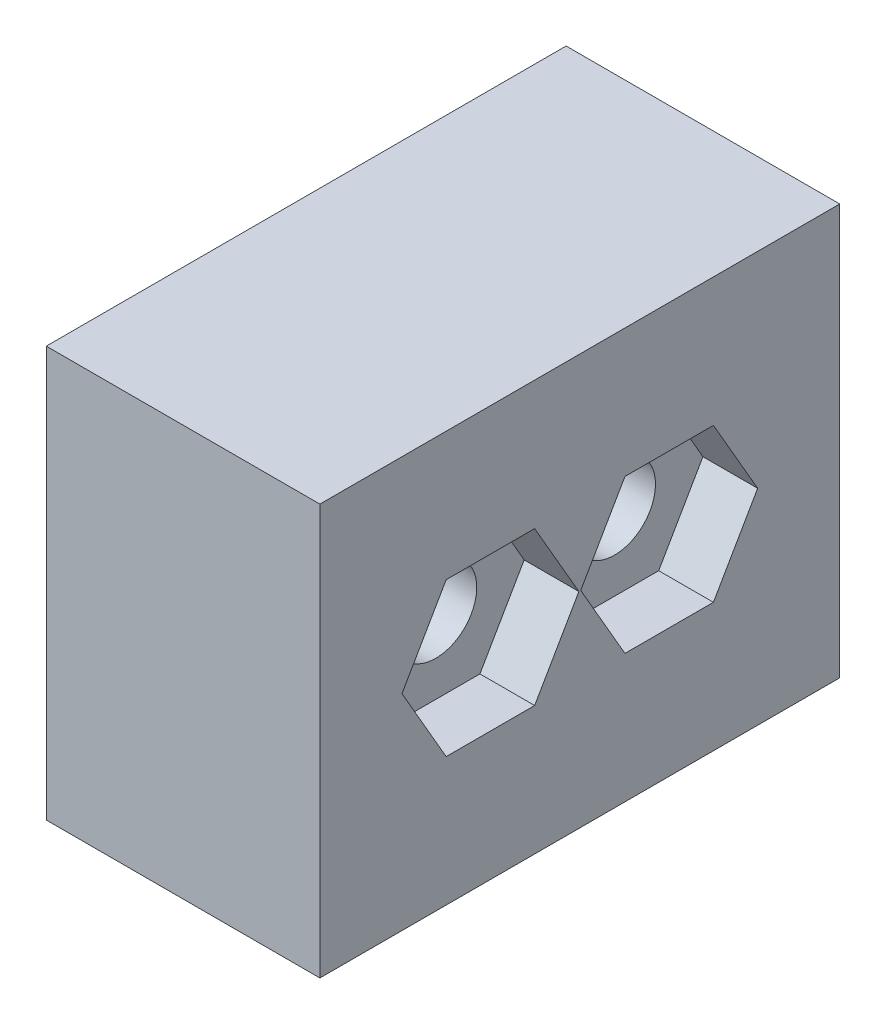
ISO-10303-21;
HEADER;
FILE_DESCRIPTION(('STEP AP214'),'2;1');
FILE_NAME('part.step','',(''),(''),'','','');
FILE_SCHEMA(('AUTOMOTIVE_DESIGN { 1 0 10303 214 1 1 1 1 }'));
ENDSEC;
DATA;
#1=APPLICATION_CONTEXT('core data for automotive mechanical design processes');
#2=APPLICATION_PROTOCOL_DEFINITION('international standard','automotive_design',2000,#1);
#3=PRODUCT_CONTEXT('',#1,'mechanical');
#4=PRODUCT('Part','Part','',(#3));
#5=PRODUCT_RELATED_PRODUCT_CATEGORY('part','',(#4));
#6=PRODUCT_DEFINITION_FORMATION('','',#4);
#7=PRODUCT_DEFINITION_CONTEXT('part definition',#1,'design');
#8=PRODUCT_DEFINITION('design','',#6,#7);
#9=PRODUCT_DEFINITION_SHAPE('','',#8);
#10=(LENGTH_UNIT() NAMED_UNIT(*) SI_UNIT(.MILLI.,.METRE.));
#11=(NAMED_UNIT(*) PLANE_ANGLE_UNIT() SI_UNIT($,.RADIAN.));
#12=(NAMED_UNIT(*) SI_UNIT($,.STERADIAN.) SOLID_ANGLE_UNIT());
#13=UNCERTAINTY_MEASURE_WITH_UNIT(LENGTH_MEASURE(1.E-05),#10,'distance_accuracy_value','');
#14=(GEOMETRIC_REPRESENTATION_CONTEXT(3) GLOBAL_UNCERTAINTY_ASSIGNED_CONTEXT((#13)) GLOBAL_UNIT_ASSIGNED_CONTEXT((#10,
#11,#12)) REPRESENTATION_CONTEXT('',''));
#15=CARTESIAN_POINT('',(0.,0.,0.));
#16=DIRECTION('',(0.,0.,1.));
#17=DIRECTION('',(1.,0.,0.));
#18=AXIS2_PLACEMENT_3D('',#15,#16,#17);
#19=CARTESIAN_POINT('',(-9.00000000000001,32.4999999999988,-12.7668384925381));
#20=DIRECTION('',(1.,0.,0.));
#21=DIRECTION('',(0.,1.,0.));
#22=AXIS2_PLACEMENT_3D('',#19,#20,#21);
#23=CYLINDRICAL_SURFACE('',#22,1.5);
#24=CARTESIAN_POINT('',(-9.00000000000001,32.4999999999988,-12.7668384925381));
#25=DIRECTION('',(1.,0.,0.));
#26=DIRECTION('',(0.,1.,0.));
#27=AXIS2_PLACEMENT_3D('',#24,#25,#26);
#28=CIRCLE('',#27,1.5);
#29=CARTESIAN_POINT('',(-9.00000000000001,33.9999999999988,-12.7668384925381));
#30=VERTEX_POINT('',#29);
#31=EDGE_CURVE('E253',#30,#30,#28,.T.);
#32=CARTESIAN_POINT('',(-1.,32.4999999999988,-12.7668384925381));
#33=DIRECTION('',(1.,0.,0.));
#34=DIRECTION('',(0.,1.,0.));
#35=AXIS2_PLACEMENT_3D('',#32,#33,#34);
#36=CIRCLE('',#35,1.5);
#37=CARTESIAN_POINT('',(-1.,33.9999999999988,-12.7668384925381));
#38=VERTEX_POINT('',#37);
#39=EDGE_CURVE('E174',#38,#38,#36,.T.);
#40=CARTESIAN_POINT('',(-9.00000000000001,33.9999999999988,-12.7668384925381));
#41=CARTESIAN_POINT('',(-8.91666666666667,33.9999999999988,-12.7668384925381));
#42=CARTESIAN_POINT('',(-8.83333333333334,33.9999999999988,-12.7668384925381));
#43=CARTESIAN_POINT('',(-8.66666666666667,33.9999999999988,-12.7668384925381));
#44=CARTESIAN_POINT('',(-8.58333333333334,33.9999999999988,-12.7668384925381));
#45=CARTESIAN_POINT('',(-8.41666666666667,33.9999999999988,-12.7668384925381));
#46=CARTESIAN_POINT('',(-8.33333333333334,33.9999999999988,-12.7668384925381));
#47=CARTESIAN_POINT('',(-8.16666666666667,33.9999999999988,-12.7668384925381));
#48=CARTESIAN_POINT('',(-8.08333333333334,33.9999999999988,-12.7668384925381));
#49=CARTESIAN_POINT('',(-7.91666666666667,33.9999999999988,-12.7668384925381));
#50=CARTESIAN_POINT('',(-7.83333333333334,33.9999999999988,-12.7668384925381));
#51=CARTESIAN_POINT('',(-7.66666666666667,33.9999999999988,-12.7668384925381));
#52=CARTESIAN_POINT('',(-7.58333333333334,33.9999999999988,-12.7668384925381));
#53=CARTESIAN_POINT('',(-7.41666666666667,33.9999999999988,-12.7668384925381));
#54=CARTESIAN_POINT('',(-7.33333333333334,33.9999999999988,-12.7668384925381));
#55=CARTESIAN_POINT('',(-7.16666666666667,33.9999999999988,-12.7668384925381));
#56=CARTESIAN_POINT('',(-7.08333333333334,33.9999999999988,-12.7668384925381));
#57=CARTESIAN_POINT('',(-6.91666666666667,33.9999999999988,-12.7668384925381));
#58=CARTESIAN_POINT('',(-6.83333333333334,33.9999999999988,-12.7668384925381));
#59=CARTESIAN_POINT('',(-6.66666666666667,33.9999999999988,-12.7668384925381));
#60=CARTESIAN_POINT('',(-6.58333333333334,33.9999999999988,-12.7668384925381));
#61=CARTESIAN_POINT('',(-6.41666666666667,33.9999999999988,-12.7668384925381));
#62=CARTESIAN_POINT('',(-6.33333333333334,33.9999999999988,-12.7668384925381));
#63=CARTESIAN_POINT('',(-6.16666666666667,33.9999999999988,-12.7668384925381));
#64=CARTESIAN_POINT('',(-6.08333333333334,33.9999999999988,-12.7668384925381));
#65=CARTESIAN_POINT('',(-5.91666666666667,33.9999999999988,-12.7668384925381));
#66=CARTESIAN_POINT('',(-5.83333333333334,33.9999999999988,-12.7668384925381));
#67=CARTESIAN_POINT('',(-5.66666666666667,33.9999999999988,-12.7668384925381));
#68=CARTESIAN_POINT('',(-5.58333333333334,33.9999999999988,-12.7668384925381));
#69=CARTESIAN_POINT('',(-5.41666666666667,33.9999999999988,-12.7668384925381));
#70=CARTESIAN_POINT('',(-5.33333333333334,33.9999999999988,-12.7668384925381));
#71=CARTESIAN_POINT('',(-5.16666666666667,33.9999999999988,-12.7668384925381));
#72=CARTESIAN_POINT('',(-5.08333333333334,33.9999999999988,-12.7668384925381));
#73=CARTESIAN_POINT('',(-4.91666666666667,33.9999999999988,-12.7668384925381));
#74=CARTESIAN_POINT('',(-4.83333333333334,33.9999999999988,-12.7668384925381));
#75=CARTESIAN_POINT('',(-4.66666666666667,33.9999999999988,-12.7668384925381));
#76=CARTESIAN_POINT('',(-4.58333333333334,33.9999999999988,-12.7668384925381));
#77=CARTESIAN_POINT('',(-4.41666666666667,33.9999999999988,-12.7668384925381));
#78=CARTESIAN_POINT('',(-4.33333333333334,33.9999999999988,-12.7668384925381));
#79=CARTESIAN_POINT('',(-4.16666666666667,33.9999999999988,-12.7668384925381));
#80=CARTESIAN_POINT('',(-4.08333333333334,33.9999999999988,-12.7668384925381));
#81=CARTESIAN_POINT('',(-3.91666666666667,33.9999999999988,-12.7668384925381));
#82=CARTESIAN_POINT('',(-3.83333333333334,33.9999999999988,-12.7668384925381));
#83=CARTESIAN_POINT('',(-3.66666666666667,33.9999999999988,-12.7668384925381));
#84=CARTESIAN_POINT('',(-3.58333333333334,33.9999999999988,-12.7668384925381));
#85=CARTESIAN_POINT('',(-3.41666666666667,33.9999999999988,-12.7668384925381));
#86=CARTESIAN_POINT('',(-3.33333333333334,33.9999999999988,-12.7668384925381));
#87=CARTESIAN_POINT('',(-3.16666666666667,33.9999999999988,-12.7668384925381));
#88=CARTESIAN_POINT('',(-3.08333333333334,33.9999999999988,-12.7668384925381));
#89=CARTESIAN_POINT('',(-2.91666666666667,33.9999999999988,-12.7668384925381));
#90=CARTESIAN_POINT('',(-2.83333333333334,33.9999999999988,-12.7668384925381));
#91=CARTESIAN_POINT('',(-2.66666666666667,33.9999999999988,-12.7668384925381));
#92=CARTESIAN_POINT('',(-2.58333333333334,33.9999999999988,-12.7668384925381));
#93=CARTESIAN_POINT('',(-2.41666666666667,33.9999999999988,-12.7668384925381));
#94=CARTESIAN_POINT('',(-2.33333333333334,33.9999999999988,-12.7668384925381));
#95=CARTESIAN_POINT('',(-2.16666666666667,33.9999999999988,-12.7668384925381));
#96=CARTESIAN_POINT('',(-2.08333333333334,33.9999999999988,-12.7668384925381));
#97=CARTESIAN_POINT('',(-1.91666666666667,33.9999999999988,-12.7668384925381));
#98=CARTESIAN_POINT('',(-1.83333333333334,33.9999999999988,-12.7668384925381));
#99=CARTESIAN_POINT('',(-1.66666666666667,33.9999999999988,-12.7668384925381));
#100=CARTESIAN_POINT('',(-1.58333333333333,33.9999999999988,-12.7668384925381));
#101=CARTESIAN_POINT('',(-1.41666666666667,33.9999999999988,-12.7668384925381));
#102=CARTESIAN_POINT('',(-1.33333333333333,33.9999999999988,-12.7668384925381));
#103=CARTESIAN_POINT('',(-1.16666666666667,33.9999999999988,-12.7668384925381));
#104=CARTESIAN_POINT('',(-1.08333333333334,33.9999999999988,-12.7668384925381));
#105=CARTESIAN_POINT('',(-1.,33.9999999999988,-12.7668384925381));
#106=B_SPLINE_CURVE_WITH_KNOTS('',3,(#40,#41,#42,#43,#44,#45,#46,#47,#48,#49,#50,#51,#52,#53,
#54,#55,#56,#57,#58,#59,#60,#61,#62,#63,#64,#65,#66,#67,#68,#69,#70,#71,#72,#73,#74,#75,#76,#77,
#78,#79,#80,#81,#82,#83,#84,#85,#86,#87,#88,#89,#90,#91,#92,#93,#94,#95,#96,#97,#98,#99,#100,
#101,#102,#103,#104,#105),.UNSPECIFIED.,.F.,.F.,(4,2,2,2,2,2,2,2,2,2,2,2,2,2,2,2,2,2,2,2,2,2,2,
2,2,2,2,2,2,2,2,2,4),(0.,0.25,0.5,0.750000000000001,1.,1.25,1.5,1.75,2.,2.25,2.5,2.75,3.,3.25,
3.5,3.75,4.,4.25,4.5,4.75,5.,5.25,5.5,5.75,6.,6.25,6.5,6.75,7.,7.25,7.50000000000001,
7.75000000000001,8.),.UNSPECIFIED.);
#107=EDGE_CURVE('BSEAM33',#30,#38,#106,.T.);
#108=ORIENTED_EDGE('',*,*,#31,.F.);
#109=ORIENTED_EDGE('',*,*,#39,.T.);
#110=ORIENTED_EDGE('',*,*,#107,.T.);
#111=ORIENTED_EDGE('',*,*,#107,.F.);
#112=EDGE_LOOP('',(#108,#110,#109,#111));
#113=FACE_BOUND('',#112,.T.);
#114=ADVANCED_FACE('F33',(#113),#23,.F.);
#115=CARTESIAN_POINT('',(1.,0.,0.));
#116=DIRECTION('',(-1.,0.,0.));
#117=DIRECTION('',(0.,-1.,0.));
#118=AXIS2_PLACEMENT_3D('',#115,#116,#117);
#119=PLANE('',#118);
#120=DIRECTION('',(0.,0.866025403784439,0.5));
#121=VECTOR('',#120,1.);
#122=CARTESIAN_POINT('',(0.999999999999999,32.4999999999988,-16.));
#123=LINE('',#122,#121);
#124=CARTESIAN_POINT('',(0.999999999999999,32.4999999999988,-16.));
#125=VERTEX_POINT('',#124);
#126=CARTESIAN_POINT('',(0.999999999999999,35.2999999999988,-14.3834192462691));
#127=VERTEX_POINT('',#126);
#128=EDGE_CURVE('E184',#125,#127,#123,.T.);
#129=ORIENTED_EDGE('',*,*,#128,.F.);
#130=DIRECTION('',(0.,0.866025403784439,-0.5));
#131=VECTOR('',#130,1.);
#132=CARTESIAN_POINT('',(0.999999999999999,29.6999999999988,-14.3834192462691));
#133=LINE('',#132,#131);
#134=CARTESIAN_POINT('',(0.999999999999999,29.6999999999988,-14.3834192462691));
#135=VERTEX_POINT('',#134);
#136=EDGE_CURVE('E50',#135,#125,#133,.T.);
#137=ORIENTED_EDGE('',*,*,#136,.F.);
#138=DIRECTION('',(0.,0.,-1.));
#139=VECTOR('',#138,1.);
#140=CARTESIAN_POINT('',(0.999999999999999,29.6999999999988,-11.1502577388071));
#141=LINE('',#140,#139);
#142=CARTESIAN_POINT('',(0.999999999999999,29.6999999999988,-11.1502577388071));
#143=VERTEX_POINT('',#142);
#144=EDGE_CURVE('E168',#143,#135,#141,.T.);
#145=ORIENTED_EDGE('',*,*,#144,.F.);
#146=DIRECTION('',(0.,-0.866025403784439,-0.499999999999999));
#147=VECTOR('',#146,1.);
#148=CARTESIAN_POINT('',(0.999999999999999,32.4999999999988,-9.53367698507619));
#149=LINE('',#148,#147);
#150=CARTESIAN_POINT('',(0.999999999999999,32.4999999999988,-9.53367698507619));
#151=VERTEX_POINT('',#150);
#152=EDGE_CURVE('E171',#151,#143,#149,.T.);
#153=ORIENTED_EDGE('',*,*,#152,.F.);
#154=DIRECTION('',(0.,-0.866025403784438,0.5));
#155=VECTOR('',#154,1.);
#156=CARTESIAN_POINT('',(0.999999999999999,35.2999999999988,-11.1502577388071));
#157=LINE('',#156,#155);
#158=CARTESIAN_POINT('',(0.999999999999999,35.2999999999988,-11.1502577388071));
#159=VERTEX_POINT('',#158);
#160=EDGE_CURVE('E189',#159,#151,#157,.T.);
#161=ORIENTED_EDGE('',*,*,#160,.F.);
#162=DIRECTION('',(0.,0.,1.));
#163=VECTOR('',#162,1.);
#164=CARTESIAN_POINT('',(0.999999999999999,35.2999999999988,-14.3834192462691));
#165=LINE('',#164,#163);
#166=EDGE_CURVE('E186',#127,#159,#165,.T.);
#167=ORIENTED_EDGE('',*,*,#166,.F.);
#168=EDGE_LOOP('',(#129,#137,#145,#153,#161,#167));
#169=FACE_BOUND('',#168,.T.);
#170=DIRECTION('',(0.,0.866025403784439,-0.499999999999999));
#171=VECTOR('',#170,1.);
#172=CARTESIAN_POINT('',(0.999999999999999,32.4999999999988,-9.46632301492381));
#173=LINE('',#172,#171);
#174=CARTESIAN_POINT('',(0.999999999999999,29.6999999999988,-7.84974226119286));
#175=VERTEX_POINT('',#174);
#176=CARTESIAN_POINT('',(0.999999999999999,32.4999999999988,-9.46632301492381));
#177=VERTEX_POINT('',#176);
#178=EDGE_CURVE('E228',#175,#177,#173,.T.);
#179=ORIENTED_EDGE('',*,*,#178,.F.);
#180=DIRECTION('',(0.,0.,-1.));
#181=VECTOR('',#180,1.);
#182=CARTESIAN_POINT('',(0.999999999999999,29.6999999999988,-7.84974226119286));
#183=LINE('',#182,#181);
#184=CARTESIAN_POINT('',(0.999999999999999,29.6999999999988,-4.61658075373095));
#185=VERTEX_POINT('',#184);
#186=EDGE_CURVE('E58',#185,#175,#183,.T.);
#187=ORIENTED_EDGE('',*,*,#186,.F.);
#188=DIRECTION('',(0.,-0.866025403784439,-0.5));
#189=VECTOR('',#188,1.);
#190=CARTESIAN_POINT('',(0.999999999999999,29.6999999999988,-4.61658075373095));
#191=LINE('',#190,#189);
#192=CARTESIAN_POINT('',(0.999999999999999,32.4999999999988,-3.));
#193=VERTEX_POINT('',#192);
#194=EDGE_CURVE('E211',#193,#185,#191,.T.);
#195=ORIENTED_EDGE('',*,*,#194,.F.);
#196=DIRECTION('',(0.,-0.866025403784439,0.5));
#197=VECTOR('',#196,1.);
#198=CARTESIAN_POINT('',(0.999999999999999,32.4999999999988,-3.));
#199=LINE('',#198,#197);
#200=CARTESIAN_POINT('',(0.999999999999999,35.2999999999988,-4.61658075373095));
#201=VERTEX_POINT('',#200);
#202=EDGE_CURVE('E237',#201,#193,#199,.T.);
#203=ORIENTED_EDGE('',*,*,#202,.F.);
#204=DIRECTION('',(0.,0.,1.));
#205=VECTOR('',#204,1.);
#206=CARTESIAN_POINT('',(0.999999999999999,35.2999999999988,-4.61658075373095));
#207=LINE('',#206,#205);
#208=CARTESIAN_POINT('',(0.999999999999999,35.2999999999988,-7.84974226119286));
#209=VERTEX_POINT('',#208);
#210=EDGE_CURVE('E234',#209,#201,#207,.T.);
#211=ORIENTED_EDGE('',*,*,#210,.F.);
#212=DIRECTION('',(0.,0.866025403784438,0.5));
#213=VECTOR('',#212,1.);
#214=CARTESIAN_POINT('',(0.999999999999999,35.2999999999988,-7.84974226119286));
#215=LINE('',#214,#213);
#216=EDGE_CURVE('E231',#177,#209,#215,.T.);
#217=ORIENTED_EDGE('',*,*,#216,.F.);
#218=EDGE_LOOP('',(#179,#187,#195,#203,#211,#217));
#219=FACE_BOUND('',#218,.T.);
#220=DIRECTION('',(0.,1.,0.));
#221=VECTOR('',#220,1.);
#222=CARTESIAN_POINT('',(0.999999999999999,24.9999999999988,0.));
#223=LINE('',#222,#221);
#224=CARTESIAN_POINT('',(0.999999999999999,24.9999999999988,0.));
#225=VERTEX_POINT('',#224);
#226=CARTESIAN_POINT('',(0.999999999999997,39.9999999999988,0.));
#227=VERTEX_POINT('',#226);
#228=EDGE_CURVE('E259',#225,#227,#223,.T.);
#229=ORIENTED_EDGE('',*,*,#228,.F.);
#230=DIRECTION('',(0.,0.,1.));
#231=VECTOR('',#230,1.);
#232=CARTESIAN_POINT('',(0.999999999999999,24.9999999999988,0.));
#233=LINE('',#232,#231);
#234=CARTESIAN_POINT('',(0.999999999999999,24.9999999999988,-19.));
#235=VERTEX_POINT('',#234);
#236=EDGE_CURVE('E269',#235,#225,#233,.T.);
#237=ORIENTED_EDGE('',*,*,#236,.F.);
#238=DIRECTION('',(0.,-1.,0.));
#239=VECTOR('',#238,1.);
#240=CARTESIAN_POINT('',(0.999999999999999,24.9999999999988,-19.));
#241=LINE('',#240,#239);
#242=CARTESIAN_POINT('',(0.999999999999997,39.9999999999988,-19.));
#243=VERTEX_POINT('',#242);
#244=EDGE_CURVE('E266',#243,#235,#241,.T.);
#245=ORIENTED_EDGE('',*,*,#244,.F.);
#246=DIRECTION('',(0.,0.,-1.));
#247=VECTOR('',#246,1.);
#248=CARTESIAN_POINT('',(0.999999999999997,39.9999999999988,0.));
#249=LINE('',#248,#247);
#250=EDGE_CURVE('E262',#227,#243,#249,.T.);
#251=ORIENTED_EDGE('',*,*,#250,.F.);
#252=EDGE_LOOP('',(#229,#237,#245,#251));
#253=FACE_BOUND('',#252,.T.);
#254=ADVANCED_FACE('F299',(#169,#219,#253),#119,.F.);
#255=CARTESIAN_POINT('',(-9.,0.,0.));
#256=DIRECTION('',(-1.,0.,0.));
#257=DIRECTION('',(0.,-1.,0.));
#258=AXIS2_PLACEMENT_3D('',#255,#256,#257);
#259=PLANE('',#258);
#260=CARTESIAN_POINT('',(-9.00000000000001,32.4999999999988,-6.2331615074619));
#261=DIRECTION('',(-1.,0.,0.));
#262=DIRECTION('',(0.,-1.,0.));
#263=AXIS2_PLACEMENT_3D('',#260,#261,#262);
#264=CIRCLE('',#263,1.5);
#265=CARTESIAN_POINT('',(-9.00000000000001,33.9999999999988,-6.2331615074619));
#266=VERTEX_POINT('',#265);
#267=EDGE_CURVE('E196',#266,#266,#264,.T.);
#268=ORIENTED_EDGE('',*,*,#267,.F.);
#269=EDGE_LOOP('',(#268));
#270=FACE_BOUND('',#269,.T.);
#271=DIRECTION('',(0.,1.,0.));
#272=VECTOR('',#271,1.);
#273=CARTESIAN_POINT('',(-9.,24.9999999999988,0.));
#274=LINE('',#273,#272);
#275=CARTESIAN_POINT('',(-9.,24.9999999999988,0.));
#276=VERTEX_POINT('',#275);
#277=CARTESIAN_POINT('',(-9.,39.9999999999988,0.));
#278=VERTEX_POINT('',#277);
#279=EDGE_CURVE('E256',#276,#278,#274,.T.);
#280=ORIENTED_EDGE('',*,*,#279,.T.);
#281=DIRECTION('',(0.,0.,-1.));
#282=VECTOR('',#281,1.);
#283=CARTESIAN_POINT('',(-9.,39.9999999999988,0.));
#284=LINE('',#283,#282);
#285=CARTESIAN_POINT('',(-9.,39.9999999999988,-19.));
#286=VERTEX_POINT('',#285);
#287=EDGE_CURVE('E274',#278,#286,#284,.T.);
#288=ORIENTED_EDGE('',*,*,#287,.T.);
#289=DIRECTION('',(0.,-1.,0.));
#290=VECTOR('',#289,1.);
#291=CARTESIAN_POINT('',(-9.,24.9999999999988,-19.));
#292=LINE('',#291,#290);
#293=CARTESIAN_POINT('',(-9.,24.9999999999988,-19.));
#294=VERTEX_POINT('',#293);
#295=EDGE_CURVE('E277',#286,#294,#292,.T.);
#296=ORIENTED_EDGE('',*,*,#295,.T.);
#297=DIRECTION('',(0.,0.,1.));
#298=VECTOR('',#297,1.);
#299=CARTESIAN_POINT('',(-9.,24.9999999999988,0.));
#300=LINE('',#299,#298);
#301=EDGE_CURVE('E263',#294,#276,#300,.T.);
#302=ORIENTED_EDGE('',*,*,#301,.T.);
#303=EDGE_LOOP('',(#280,#288,#296,#302));
#304=FACE_BOUND('',#303,.T.);
#305=ORIENTED_EDGE('',*,*,#31,.T.);
#306=EDGE_LOOP('',(#305));
#307=FACE_BOUND('',#306,.T.);
#308=ADVANCED_FACE('F292',(#270,#304,#307),#259,.T.);
#309=CARTESIAN_POINT('',(0.999999999999999,24.9999999999988,0.));
#310=DIRECTION('',(0.,0.,1.));
#311=DIRECTION('',(1.,0.,0.));
#312=AXIS2_PLACEMENT_3D('',#309,#310,#311);
#313=PLANE('',#312);
#314=ORIENTED_EDGE('',*,*,#279,.F.);
#315=DIRECTION('',(-1.,0.,0.));
#316=VECTOR('',#315,1.);
#317=CARTESIAN_POINT('',(0.999999999999999,24.9999999999988,0.));
#318=LINE('',#317,#316);
#319=EDGE_CURVE('E11',#225,#276,#318,.T.);
#320=ORIENTED_EDGE('',*,*,#319,.F.);
#321=ORIENTED_EDGE('',*,*,#228,.T.);
#322=DIRECTION('',(-1.,0.,0.));
#323=VECTOR('',#322,1.);
#324=CARTESIAN_POINT('',(0.999999999999997,39.9999999999988,0.));
#325=LINE('',#324,#323);
#326=EDGE_CURVE('E37',#227,#278,#325,.T.);
#327=ORIENTED_EDGE('',*,*,#326,.T.);
#328=EDGE_LOOP('',(#314,#320,#321,#327));
#329=FACE_BOUND('',#328,.T.);
#330=ADVANCED_FACE('F35',(#329),#313,.T.);
#331=CARTESIAN_POINT('',(0.999999999999999,24.9999999999988,0.));
#332=DIRECTION('',(0.,-1.,0.));
#333=DIRECTION('',(0.,0.,-1.));
#334=AXIS2_PLACEMENT_3D('',#331,#332,#333);
#335=PLANE('',#334);
#336=ORIENTED_EDGE('',*,*,#301,.F.);
#337=DIRECTION('',(-1.,0.,0.));
#338=VECTOR('',#337,1.);
#339=CARTESIAN_POINT('',(0.999999999999999,24.9999999999988,-19.));
#340=LINE('',#339,#338);
#341=EDGE_CURVE('E42',#235,#294,#340,.T.);
#342=ORIENTED_EDGE('',*,*,#341,.F.);
#343=ORIENTED_EDGE('',*,*,#236,.T.);
#344=ORIENTED_EDGE('',*,*,#319,.T.);
#345=EDGE_LOOP('',(#336,#342,#343,#344));
#346=FACE_BOUND('',#345,.T.);
#347=ADVANCED_FACE('F296',(#346),#335,.T.);
#348=CARTESIAN_POINT('',(0.999999999999999,24.9999999999988,-19.));
#349=DIRECTION('',(0.,0.,-1.));
#350=DIRECTION('',(-1.,0.,0.));
#351=AXIS2_PLACEMENT_3D('',#348,#349,#350);
#352=PLANE('',#351);
#353=ORIENTED_EDGE('',*,*,#295,.F.);
#354=DIRECTION('',(-1.,0.,0.));
#355=VECTOR('',#354,1.);
#356=CARTESIAN_POINT('',(0.999999999999997,39.9999999999988,-19.));
#357=LINE('',#356,#355);
#358=EDGE_CURVE('E282',#243,#286,#357,.T.);
#359=ORIENTED_EDGE('',*,*,#358,.F.);
#360=ORIENTED_EDGE('',*,*,#244,.T.);
#361=ORIENTED_EDGE('',*,*,#341,.T.);
#362=EDGE_LOOP('',(#353,#359,#360,#361));
#363=FACE_BOUND('',#362,.T.);
#364=ADVANCED_FACE('F302',(#363),#352,.T.);
#365=CARTESIAN_POINT('',(0.999999999999997,39.9999999999988,0.));
#366=DIRECTION('',(0.,1.,0.));
#367=DIRECTION('',(0.,0.,1.));
#368=AXIS2_PLACEMENT_3D('',#365,#366,#367);
#369=PLANE('',#368);
#370=ORIENTED_EDGE('',*,*,#287,.F.);
#371=ORIENTED_EDGE('',*,*,#326,.F.);
#372=ORIENTED_EDGE('',*,*,#250,.T.);
#373=ORIENTED_EDGE('',*,*,#358,.T.);
#374=EDGE_LOOP('',(#370,#371,#372,#373));
#375=FACE_BOUND('',#374,.T.);
#376=ADVANCED_FACE('F290',(#375),#369,.T.);
#377=CARTESIAN_POINT('',(-9.00000000000001,32.4999999999988,-6.2331615074619));
#378=DIRECTION('',(1.,0.,0.));
#379=DIRECTION('',(0.,1.,0.));
#380=AXIS2_PLACEMENT_3D('',#377,#378,#379);
#381=CYLINDRICAL_SURFACE('',#380,1.5);
#382=CARTESIAN_POINT('',(-1.,32.4999999999988,-6.2331615074619));
#383=DIRECTION('',(1.,0.,0.));
#384=DIRECTION('',(0.,-1.,0.));
#385=AXIS2_PLACEMENT_3D('',#382,#383,#384);
#386=CIRCLE('',#385,1.5);
#387=CARTESIAN_POINT('',(-1.,33.9999999999988,-6.2331615074619));
#388=VERTEX_POINT('',#387);
#389=EDGE_CURVE('E204',#388,#388,#386,.T.);
#390=CARTESIAN_POINT('',(-1.,33.9999999999988,-6.2331615074619));
#391=CARTESIAN_POINT('',(-1.08333333333334,33.9999999999988,-6.2331615074619));
#392=CARTESIAN_POINT('',(-1.16666666666667,33.9999999999988,-6.2331615074619));
#393=CARTESIAN_POINT('',(-1.33333333333334,33.9999999999988,-6.2331615074619));
#394=CARTESIAN_POINT('',(-1.41666666666667,33.9999999999988,-6.2331615074619));
#395=CARTESIAN_POINT('',(-1.58333333333334,33.9999999999988,-6.2331615074619));
#396=CARTESIAN_POINT('',(-1.66666666666667,33.9999999999988,-6.2331615074619));
#397=CARTESIAN_POINT('',(-1.83333333333334,33.9999999999988,-6.2331615074619));
#398=CARTESIAN_POINT('',(-1.91666666666667,33.9999999999988,-6.2331615074619));
#399=CARTESIAN_POINT('',(-2.08333333333334,33.9999999999988,-6.2331615074619));
#400=CARTESIAN_POINT('',(-2.16666666666667,33.9999999999988,-6.2331615074619));
#401=CARTESIAN_POINT('',(-2.33333333333334,33.9999999999988,-6.2331615074619));
#402=CARTESIAN_POINT('',(-2.41666666666667,33.9999999999988,-6.2331615074619));
#403=CARTESIAN_POINT('',(-2.58333333333334,33.9999999999988,-6.2331615074619));
#404=CARTESIAN_POINT('',(-2.66666666666667,33.9999999999988,-6.2331615074619));
#405=CARTESIAN_POINT('',(-2.83333333333334,33.9999999999988,-6.2331615074619));
#406=CARTESIAN_POINT('',(-2.91666666666667,33.9999999999988,-6.2331615074619));
#407=CARTESIAN_POINT('',(-3.08333333333334,33.9999999999988,-6.2331615074619));
#408=CARTESIAN_POINT('',(-3.16666666666667,33.9999999999988,-6.2331615074619));
#409=CARTESIAN_POINT('',(-3.33333333333334,33.9999999999988,-6.2331615074619));
#410=CARTESIAN_POINT('',(-3.41666666666667,33.9999999999988,-6.2331615074619));
#411=CARTESIAN_POINT('',(-3.58333333333334,33.9999999999988,-6.2331615074619));
#412=CARTESIAN_POINT('',(-3.66666666666667,33.9999999999988,-6.2331615074619));
#413=CARTESIAN_POINT('',(-3.83333333333334,33.9999999999988,-6.2331615074619));
#414=CARTESIAN_POINT('',(-3.91666666666667,33.9999999999988,-6.2331615074619));
#415=CARTESIAN_POINT('',(-4.08333333333334,33.9999999999988,-6.2331615074619));
#416=CARTESIAN_POINT('',(-4.16666666666667,33.9999999999988,-6.2331615074619));
#417=CARTESIAN_POINT('',(-4.33333333333334,33.9999999999988,-6.2331615074619));
#418=CARTESIAN_POINT('',(-4.41666666666667,33.9999999999988,-6.2331615074619));
#419=CARTESIAN_POINT('',(-4.58333333333334,33.9999999999988,-6.2331615074619));
#420=CARTESIAN_POINT('',(-4.66666666666667,33.9999999999988,-6.2331615074619));
#421=CARTESIAN_POINT('',(-4.83333333333334,33.9999999999988,-6.2331615074619));
#422=CARTESIAN_POINT('',(-4.91666666666667,33.9999999999988,-6.2331615074619));
#423=CARTESIAN_POINT('',(-5.08333333333334,33.9999999999988,-6.2331615074619));
#424=CARTESIAN_POINT('',(-5.16666666666667,33.9999999999988,-6.2331615074619));
#425=CARTESIAN_POINT('',(-5.33333333333334,33.9999999999988,-6.2331615074619));
#426=CARTESIAN_POINT('',(-5.41666666666667,33.9999999999988,-6.2331615074619));
#427=CARTESIAN_POINT('',(-5.58333333333334,33.9999999999988,-6.2331615074619));
#428=CARTESIAN_POINT('',(-5.66666666666667,33.9999999999988,-6.2331615074619));
#429=CARTESIAN_POINT('',(-5.83333333333334,33.9999999999988,-6.2331615074619));
#430=CARTESIAN_POINT('',(-5.91666666666667,33.9999999999988,-6.2331615074619));
#431=CARTESIAN_POINT('',(-6.08333333333334,33.9999999999988,-6.2331615074619));
#432=CARTESIAN_POINT('',(-6.16666666666667,33.9999999999988,-6.2331615074619));
#433=CARTESIAN_POINT('',(-6.33333333333334,33.9999999999988,-6.2331615074619));
#434=CARTESIAN_POINT('',(-6.41666666666667,33.9999999999988,-6.2331615074619));
#435=CARTESIAN_POINT('',(-6.58333333333334,33.9999999999988,-6.2331615074619));
#436=CARTESIAN_POINT('',(-6.66666666666667,33.9999999999988,-6.2331615074619));
#437=CARTESIAN_POINT('',(-6.83333333333334,33.9999999999988,-6.2331615074619));
#438=CARTESIAN_POINT('',(-6.91666666666667,33.9999999999988,-6.2331615074619));
#439=CARTESIAN_POINT('',(-7.08333333333334,33.9999999999988,-6.2331615074619));
#440=CARTESIAN_POINT('',(-7.16666666666667,33.9999999999988,-6.2331615074619));
#441=CARTESIAN_POINT('',(-7.33333333333334,33.9999999999988,-6.2331615074619));
#442=CARTESIAN_POINT('',(-7.41666666666667,33.9999999999988,-6.2331615074619));
#443=CARTESIAN_POINT('',(-7.58333333333334,33.9999999999988,-6.2331615074619));
#444=CARTESIAN_POINT('',(-7.66666666666667,33.9999999999988,-6.2331615074619));
#445=CARTESIAN_POINT('',(-7.83333333333334,33.9999999999988,-6.2331615074619));
#446=CARTESIAN_POINT('',(-7.91666666666667,33.9999999999988,-6.2331615074619));
#447=CARTESIAN_POINT('',(-8.08333333333334,33.9999999999988,-6.2331615074619));
#448=CARTESIAN_POINT('',(-8.16666666666667,33.9999999999988,-6.2331615074619));
#449=CARTESIAN_POINT('',(-8.33333333333334,33.9999999999988,-6.2331615074619));
#450=CARTESIAN_POINT('',(-8.41666666666667,33.9999999999988,-6.2331615074619));
#451=CARTESIAN_POINT('',(-8.58333333333334,33.9999999999988,-6.2331615074619));
#452=CARTESIAN_POINT('',(-8.66666666666667,33.9999999999988,-6.2331615074619));
#453=CARTESIAN_POINT('',(-8.83333333333334,33.9999999999988,-6.2331615074619));
#454=CARTESIAN_POINT('',(-8.91666666666667,33.9999999999988,-6.2331615074619));
#455=CARTESIAN_POINT('',(-9.00000000000001,33.9999999999988,-6.2331615074619));
#456=B_SPLINE_CURVE_WITH_KNOTS('',3,(#390,#391,#392,#393,#394,#395,#396,#397,#398,#399,#400,
#401,#402,#403,#404,#405,#406,#407,#408,#409,#410,#411,#412,#413,#414,#415,#416,#417,#418,#419,
#420,#421,#422,#423,#424,#425,#426,#427,#428,#429,#430,#431,#432,#433,#434,#435,#436,#437,#438,
#439,#440,#441,#442,#443,#444,#445,#446,#447,#448,#449,#450,#451,#452,#453,#454,#455),
.UNSPECIFIED.,.F.,.F.,(4,2,2,2,2,2,2,2,2,2,2,2,2,2,2,2,2,2,2,2,2,2,2,2,2,2,2,2,2,2,2,2,4),(0.,
0.249999999999999,0.5,0.75,1.,1.25,1.5,1.75,2.,2.25,2.5,2.75,3.,3.25,3.5,3.75,4.,4.25,4.5,4.75,
5.,5.25,5.5,5.75,6.,6.25,6.5,6.75,7.,7.25,7.5,7.75,8.),.UNSPECIFIED.);
#457=EDGE_CURVE('BSEAM309',#388,#266,#456,.T.);
#458=ORIENTED_EDGE('',*,*,#389,.T.);
#459=ORIENTED_EDGE('',*,*,#267,.T.);
#460=ORIENTED_EDGE('',*,*,#457,.T.);
#461=ORIENTED_EDGE('',*,*,#457,.F.);
#462=EDGE_LOOP('',(#458,#460,#459,#461));
#463=FACE_BOUND('',#462,.T.);
#464=ADVANCED_FACE('F309',(#463),#381,.F.);
#465=CARTESIAN_POINT('',(-1.,29.6999999999988,-14.3834192462691));
#466=DIRECTION('',(0.,-0.5,-0.866025403784439));
#467=DIRECTION('',(0.,0.866025403784439,-0.5));
#468=AXIS2_PLACEMENT_3D('',#465,#466,#467);
#469=PLANE('',#468);
#470=ORIENTED_EDGE('',*,*,#136,.T.);
#471=DIRECTION('',(1.,0.,0.));
#472=VECTOR('',#471,1.);
#473=CARTESIAN_POINT('',(-1.,32.4999999999988,-16.));
#474=LINE('',#473,#472);
#475=CARTESIAN_POINT('',(-1.,32.4999999999988,-16.));
#476=VERTEX_POINT('',#475);
#477=EDGE_CURVE('E145',#476,#125,#474,.T.);
#478=ORIENTED_EDGE('',*,*,#477,.F.);
#479=DIRECTION('',(0.,0.866025403784439,-0.5));
#480=VECTOR('',#479,1.);
#481=CARTESIAN_POINT('',(-1.,29.6999999999988,-14.3834192462691));
#482=LINE('',#481,#480);
#483=CARTESIAN_POINT('',(-1.,29.6999999999988,-14.3834192462691));
#484=VERTEX_POINT('',#483);
#485=EDGE_CURVE('E149',#484,#476,#482,.T.);
#486=ORIENTED_EDGE('',*,*,#485,.F.);
#487=DIRECTION('',(1.,0.,0.));
#488=VECTOR('',#487,1.);
#489=CARTESIAN_POINT('',(-1.,29.6999999999988,-14.3834192462691));
#490=LINE('',#489,#488);
#491=EDGE_CURVE('E194',#484,#135,#490,.T.);
#492=ORIENTED_EDGE('',*,*,#491,.T.);
#493=EDGE_LOOP('',(#470,#478,#486,#492));
#494=FACE_BOUND('',#493,.T.);
#495=ADVANCED_FACE('F147',(#494),#469,.F.);
#496=CARTESIAN_POINT('',(-1.,29.6999999999988,-11.1502577388071));
#497=DIRECTION('',(0.,-1.,0.));
#498=DIRECTION('',(1.,0.,0.));
#499=AXIS2_PLACEMENT_3D('',#496,#497,#498);
#500=PLANE('',#499);
#501=ORIENTED_EDGE('',*,*,#144,.T.);
#502=ORIENTED_EDGE('',*,*,#491,.F.);
#503=DIRECTION('',(0.,0.,-1.));
#504=VECTOR('',#503,1.);
#505=CARTESIAN_POINT('',(-1.,29.6999999999988,-11.1502577388071));
#506=LINE('',#505,#504);
#507=CARTESIAN_POINT('',(-1.,29.6999999999988,-11.1502577388071));
#508=VERTEX_POINT('',#507);
#509=EDGE_CURVE('E155',#508,#484,#506,.T.);
#510=ORIENTED_EDGE('',*,*,#509,.F.);
#511=DIRECTION('',(1.,0.,0.));
#512=VECTOR('',#511,1.);
#513=CARTESIAN_POINT('',(-1.,29.6999999999988,-11.1502577388071));
#514=LINE('',#513,#512);
#515=EDGE_CURVE('E197',#508,#143,#514,.T.);
#516=ORIENTED_EDGE('',*,*,#515,.T.);
#517=EDGE_LOOP('',(#501,#502,#510,#516));
#518=FACE_BOUND('',#517,.T.);
#519=ADVANCED_FACE('F380',(#518),#500,.F.);
#520=CARTESIAN_POINT('',(-1.,32.4999999999988,-9.53367698507619));
#521=DIRECTION('',(0.,-0.499999999999999,0.866025403784439));
#522=DIRECTION('',(0.,-0.866025403784439,-0.499999999999999));
#523=AXIS2_PLACEMENT_3D('',#520,#521,#522);
#524=PLANE('',#523);
#525=ORIENTED_EDGE('',*,*,#152,.T.);
#526=ORIENTED_EDGE('',*,*,#515,.F.);
#527=DIRECTION('',(0.,-0.866025403784439,-0.499999999999999));
#528=VECTOR('',#527,1.);
#529=CARTESIAN_POINT('',(-1.,32.4999999999988,-9.53367698507619));
#530=LINE('',#529,#528);
#531=CARTESIAN_POINT('',(-1.,32.4999999999988,-9.53367698507619));
#532=VERTEX_POINT('',#531);
#533=EDGE_CURVE('E180',#532,#508,#530,.T.);
#534=ORIENTED_EDGE('',*,*,#533,.F.);
#535=DIRECTION('',(1.,0.,0.));
#536=VECTOR('',#535,1.);
#537=CARTESIAN_POINT('',(-1.,32.4999999999988,-9.53367698507619));
#538=LINE('',#537,#536);
#539=EDGE_CURVE('E199',#532,#151,#538,.T.);
#540=ORIENTED_EDGE('',*,*,#539,.T.);
#541=EDGE_LOOP('',(#525,#526,#534,#540));
#542=FACE_BOUND('',#541,.T.);
#543=ADVANCED_FACE('F389',(#542),#524,.F.);
#544=CARTESIAN_POINT('',(-1.,35.2999999999988,-11.1502577388071));
#545=DIRECTION('',(0.,0.5,0.866025403784438));
#546=DIRECTION('',(0.,-0.866025403784438,0.5));
#547=AXIS2_PLACEMENT_3D('',#544,#545,#546);
#548=PLANE('',#547);
#549=ORIENTED_EDGE('',*,*,#160,.T.);
#550=ORIENTED_EDGE('',*,*,#539,.F.);
#551=DIRECTION('',(0.,-0.866025403784438,0.5));
#552=VECTOR('',#551,1.);
#553=CARTESIAN_POINT('',(-1.,35.2999999999988,-11.1502577388071));
#554=LINE('',#553,#552);
#555=CARTESIAN_POINT('',(-1.,35.2999999999988,-11.1502577388071));
#556=VERTEX_POINT('',#555);
#557=EDGE_CURVE('E177',#556,#532,#554,.T.);
#558=ORIENTED_EDGE('',*,*,#557,.F.);
#559=DIRECTION('',(1.,0.,0.));
#560=VECTOR('',#559,1.);
#561=CARTESIAN_POINT('',(-1.,35.2999999999988,-11.1502577388071));
#562=LINE('',#561,#560);
#563=EDGE_CURVE('E201',#556,#159,#562,.T.);
#564=ORIENTED_EDGE('',*,*,#563,.T.);
#565=EDGE_LOOP('',(#549,#550,#558,#564));
#566=FACE_BOUND('',#565,.T.);
#567=ADVANCED_FACE('F399',(#566),#548,.F.);
#568=CARTESIAN_POINT('',(-1.,35.2999999999988,-14.3834192462691));
#569=DIRECTION('',(0.,1.,0.));
#570=DIRECTION('',(-1.,0.,0.));
#571=AXIS2_PLACEMENT_3D('',#568,#569,#570);
#572=PLANE('',#571);
#573=ORIENTED_EDGE('',*,*,#166,.T.);
#574=ORIENTED_EDGE('',*,*,#563,.F.);
#575=DIRECTION('',(0.,0.,1.));
#576=VECTOR('',#575,1.);
#577=CARTESIAN_POINT('',(-1.,35.2999999999988,-14.3834192462691));
#578=LINE('',#577,#576);
#579=CARTESIAN_POINT('',(-1.,35.2999999999988,-14.3834192462691));
#580=VERTEX_POINT('',#579);
#581=EDGE_CURVE('E163',#580,#556,#578,.T.);
#582=ORIENTED_EDGE('',*,*,#581,.F.);
#583=DIRECTION('',(1.,0.,0.));
#584=VECTOR('',#583,1.);
#585=CARTESIAN_POINT('',(-1.,35.2999999999988,-14.3834192462691));
#586=LINE('',#585,#584);
#587=EDGE_CURVE('E154',#580,#127,#586,.T.);
#588=ORIENTED_EDGE('',*,*,#587,.T.);
#589=EDGE_LOOP('',(#573,#574,#582,#588));
#590=FACE_BOUND('',#589,.T.);
#591=ADVANCED_FACE('F409',(#590),#572,.F.);
#592=CARTESIAN_POINT('',(-1.,32.4999999999988,-16.));
#593=DIRECTION('',(0.,0.5,-0.866025403784439));
#594=DIRECTION('',(0.,0.866025403784439,0.5));
#595=AXIS2_PLACEMENT_3D('',#592,#593,#594);
#596=PLANE('',#595);
#597=ORIENTED_EDGE('',*,*,#128,.T.);
#598=ORIENTED_EDGE('',*,*,#587,.F.);
#599=DIRECTION('',(0.,0.866025403784439,0.5));
#600=VECTOR('',#599,1.);
#601=CARTESIAN_POINT('',(-1.,32.4999999999988,-16.));
#602=LINE('',#601,#600);
#603=EDGE_CURVE('E158',#476,#580,#602,.T.);
#604=ORIENTED_EDGE('',*,*,#603,.F.);
#605=ORIENTED_EDGE('',*,*,#477,.T.);
#606=EDGE_LOOP('',(#597,#598,#604,#605));
#607=FACE_BOUND('',#606,.T.);
#608=ADVANCED_FACE('F159',(#607),#596,.F.);
#609=CARTESIAN_POINT('',(-0.999999999999999,0.,0.));
#610=DIRECTION('',(1.,0.,0.));
#611=DIRECTION('',(0.,1.,0.));
#612=AXIS2_PLACEMENT_3D('',#609,#610,#611);
#613=PLANE('',#612);
#614=ORIENTED_EDGE('',*,*,#39,.F.);
#615=EDGE_LOOP('',(#614));
#616=FACE_BOUND('',#615,.T.);
#617=ORIENTED_EDGE('',*,*,#485,.T.);
#618=ORIENTED_EDGE('',*,*,#603,.T.);
#619=ORIENTED_EDGE('',*,*,#581,.T.);
#620=ORIENTED_EDGE('',*,*,#557,.T.);
#621=ORIENTED_EDGE('',*,*,#533,.T.);
#622=ORIENTED_EDGE('',*,*,#509,.T.);
#623=EDGE_LOOP('',(#617,#618,#619,#620,#621,#622));
#624=FACE_BOUND('',#623,.T.);
#625=ADVANCED_FACE('F165',(#616,#624),#613,.T.);
#626=CARTESIAN_POINT('',(-1.,29.6999999999988,-7.84974226119286));
#627=DIRECTION('',(0.,-1.,0.));
#628=DIRECTION('',(1.,0.,0.));
#629=AXIS2_PLACEMENT_3D('',#626,#627,#628);
#630=PLANE('',#629);
#631=ORIENTED_EDGE('',*,*,#186,.T.);
#632=DIRECTION('',(1.,0.,0.));
#633=VECTOR('',#632,1.);
#634=CARTESIAN_POINT('',(-1.,29.6999999999988,-7.84974226119286));
#635=LINE('',#634,#633);
#636=CARTESIAN_POINT('',(-1.,29.6999999999988,-7.84974226119286));
#637=VERTEX_POINT('',#636);
#638=EDGE_CURVE('E226',#637,#175,#635,.T.);
#639=ORIENTED_EDGE('',*,*,#638,.F.);
#640=DIRECTION('',(0.,0.,-1.));
#641=VECTOR('',#640,1.);
#642=CARTESIAN_POINT('',(-1.,29.6999999999988,-7.84974226119286));
#643=LINE('',#642,#641);
#644=CARTESIAN_POINT('',(-1.,29.6999999999988,-4.61658075373095));
#645=VERTEX_POINT('',#644);
#646=EDGE_CURVE('E207',#645,#637,#643,.T.);
#647=ORIENTED_EDGE('',*,*,#646,.F.);
#648=DIRECTION('',(1.,0.,0.));
#649=VECTOR('',#648,1.);
#650=CARTESIAN_POINT('',(-1.,29.6999999999988,-4.61658075373095));
#651=LINE('',#650,#649);
#652=EDGE_CURVE('E242',#645,#185,#651,.T.);
#653=ORIENTED_EDGE('',*,*,#652,.T.);
#654=EDGE_LOOP('',(#631,#639,#647,#653));
#655=FACE_BOUND('',#654,.T.);
#656=ADVANCED_FACE('F323',(#655),#630,.F.);
#657=CARTESIAN_POINT('',(-1.,29.6999999999988,-4.61658075373095));
#658=DIRECTION('',(0.,-0.5,0.866025403784439));
#659=DIRECTION('',(0.,-0.866025403784439,-0.5));
#660=AXIS2_PLACEMENT_3D('',#657,#658,#659);
#661=PLANE('',#660);
#662=ORIENTED_EDGE('',*,*,#194,.T.);
#663=ORIENTED_EDGE('',*,*,#652,.F.);
#664=DIRECTION('',(0.,-0.866025403784439,-0.5));
#665=VECTOR('',#664,1.);
#666=CARTESIAN_POINT('',(-1.,29.6999999999988,-4.61658075373095));
#667=LINE('',#666,#665);
#668=CARTESIAN_POINT('',(-1.,32.4999999999988,-3.));
#669=VERTEX_POINT('',#668);
#670=EDGE_CURVE('E223',#669,#645,#667,.T.);
#671=ORIENTED_EDGE('',*,*,#670,.F.);
#672=DIRECTION('',(1.,0.,0.));
#673=VECTOR('',#672,1.);
#674=CARTESIAN_POINT('',(-1.,32.4999999999988,-3.));
#675=LINE('',#674,#673);
#676=EDGE_CURVE('E244',#669,#193,#675,.T.);
#677=ORIENTED_EDGE('',*,*,#676,.T.);
#678=EDGE_LOOP('',(#662,#663,#671,#677));
#679=FACE_BOUND('',#678,.T.);
#680=ADVANCED_FACE('F445',(#679),#661,.F.);
#681=CARTESIAN_POINT('',(-1.,32.4999999999988,-3.));
#682=DIRECTION('',(0.,0.5,0.866025403784439));
#683=DIRECTION('',(0.,-0.866025403784439,0.5));
#684=AXIS2_PLACEMENT_3D('',#681,#682,#683);
#685=PLANE('',#684);
#686=ORIENTED_EDGE('',*,*,#202,.T.);
#687=ORIENTED_EDGE('',*,*,#676,.F.);
#688=DIRECTION('',(0.,-0.866025403784439,0.5));
#689=VECTOR('',#688,1.);
#690=CARTESIAN_POINT('',(-1.,32.4999999999988,-3.));
#691=LINE('',#690,#689);
#692=CARTESIAN_POINT('',(-1.,35.2999999999988,-4.61658075373095));
#693=VERTEX_POINT('',#692);
#694=EDGE_CURVE('E220',#693,#669,#691,.T.);
#695=ORIENTED_EDGE('',*,*,#694,.F.);
#696=DIRECTION('',(1.,0.,0.));
#697=VECTOR('',#696,1.);
#698=CARTESIAN_POINT('',(-1.,35.2999999999988,-4.61658075373095));
#699=LINE('',#698,#697);
#700=EDGE_CURVE('E246',#693,#201,#699,.T.);
#701=ORIENTED_EDGE('',*,*,#700,.T.);
#702=EDGE_LOOP('',(#686,#687,#695,#701));
#703=FACE_BOUND('',#702,.T.);
#704=ADVANCED_FACE('F453',(#703),#685,.F.);
#705=CARTESIAN_POINT('',(-1.,35.2999999999988,-4.61658075373095));
#706=DIRECTION('',(0.,1.,0.));
#707=DIRECTION('',(-1.,0.,0.));
#708=AXIS2_PLACEMENT_3D('',#705,#706,#707);
#709=PLANE('',#708);
#710=ORIENTED_EDGE('',*,*,#210,.T.);
#711=ORIENTED_EDGE('',*,*,#700,.F.);
#712=DIRECTION('',(0.,0.,1.));
#713=VECTOR('',#712,1.);
#714=CARTESIAN_POINT('',(-1.,35.2999999999988,-4.61658075373095));
#715=LINE('',#714,#713);
#716=CARTESIAN_POINT('',(-1.,35.2999999999988,-7.84974226119286));
#717=VERTEX_POINT('',#716);
#718=EDGE_CURVE('E217',#717,#693,#715,.T.);
#719=ORIENTED_EDGE('',*,*,#718,.F.);
#720=DIRECTION('',(1.,0.,0.));
#721=VECTOR('',#720,1.);
#722=CARTESIAN_POINT('',(-1.,35.2999999999988,-7.84974226119286));
#723=LINE('',#722,#721);
#724=EDGE_CURVE('E248',#717,#209,#723,.T.);
#725=ORIENTED_EDGE('',*,*,#724,.T.);
#726=EDGE_LOOP('',(#710,#711,#719,#725));
#727=FACE_BOUND('',#726,.T.);
#728=ADVANCED_FACE('F463',(#727),#709,.F.);
#729=CARTESIAN_POINT('',(-1.,35.2999999999988,-7.84974226119286));
#730=DIRECTION('',(0.,0.5,-0.866025403784438));
#731=DIRECTION('',(0.,0.866025403784438,0.5));
#732=AXIS2_PLACEMENT_3D('',#729,#730,#731);
#733=PLANE('',#732);
#734=ORIENTED_EDGE('',*,*,#216,.T.);
#735=ORIENTED_EDGE('',*,*,#724,.F.);
#736=DIRECTION('',(0.,0.866025403784438,0.5));
#737=VECTOR('',#736,1.);
#738=CARTESIAN_POINT('',(-1.,35.2999999999988,-7.84974226119286));
#739=LINE('',#738,#737);
#740=CARTESIAN_POINT('',(-1.,32.4999999999988,-9.46632301492381));
#741=VERTEX_POINT('',#740);
#742=EDGE_CURVE('E214',#741,#717,#739,.T.);
#743=ORIENTED_EDGE('',*,*,#742,.F.);
#744=DIRECTION('',(1.,0.,0.));
#745=VECTOR('',#744,1.);
#746=CARTESIAN_POINT('',(-1.,32.4999999999988,-9.46632301492381));
#747=LINE('',#746,#745);
#748=EDGE_CURVE('E250',#741,#177,#747,.T.);
#749=ORIENTED_EDGE('',*,*,#748,.T.);
#750=EDGE_LOOP('',(#734,#735,#743,#749));
#751=FACE_BOUND('',#750,.T.);
#752=ADVANCED_FACE('F473',(#751),#733,.F.);
#753=CARTESIAN_POINT('',(-1.,32.4999999999988,-9.46632301492381));
#754=DIRECTION('',(0.,-0.499999999999999,-0.866025403784439));
#755=DIRECTION('',(0.,0.866025403784439,-0.499999999999999));
#756=AXIS2_PLACEMENT_3D('',#753,#754,#755);
#757=PLANE('',#756);
#758=ORIENTED_EDGE('',*,*,#178,.T.);
#759=ORIENTED_EDGE('',*,*,#748,.F.);
#760=DIRECTION('',(0.,0.866025403784439,-0.499999999999999));
#761=VECTOR('',#760,1.);
#762=CARTESIAN_POINT('',(-1.,32.4999999999988,-9.46632301492381));
#763=LINE('',#762,#761);
#764=EDGE_CURVE('E210',#637,#741,#763,.T.);
#765=ORIENTED_EDGE('',*,*,#764,.F.);
#766=ORIENTED_EDGE('',*,*,#638,.T.);
#767=EDGE_LOOP('',(#758,#759,#765,#766));
#768=FACE_BOUND('',#767,.T.);
#769=ADVANCED_FACE('F483',(#768),#757,.F.);
#770=CARTESIAN_POINT('',(-0.999999999999999,0.,0.));
#771=DIRECTION('',(-1.,0.,0.));
#772=DIRECTION('',(0.,-1.,0.));
#773=AXIS2_PLACEMENT_3D('',#770,#771,#772);
#774=PLANE('',#773);
#775=ORIENTED_EDGE('',*,*,#389,.F.);
#776=EDGE_LOOP('',(#775));
#777=FACE_BOUND('',#776,.T.);
#778=ORIENTED_EDGE('',*,*,#646,.T.);
#779=ORIENTED_EDGE('',*,*,#764,.T.);
#780=ORIENTED_EDGE('',*,*,#742,.T.);
#781=ORIENTED_EDGE('',*,*,#718,.T.);
#782=ORIENTED_EDGE('',*,*,#694,.T.);
#783=ORIENTED_EDGE('',*,*,#670,.T.);
#784=EDGE_LOOP('',(#778,#779,#780,#781,#782,#783));
#785=FACE_BOUND('',#784,.T.);
#786=ADVANCED_FACE('F493',(#777,#785),#774,.F.);
#787=CLOSED_SHELL('',(#114,#254,#308,#330,#347,#364,#376,#464,#495,#519,#543,#567,#591,#608,
#625,#656,#680,#704,#728,#752,#769,#786));
#788=MANIFOLD_SOLID_BREP('B2',#787);
#789=ADVANCED_BREP_SHAPE_REPRESENTATION('',(#18,#788),#14);
#790=SHAPE_DEFINITION_REPRESENTATION(#9,#789);
ENDSEC;
END-ISO-10303-21;
